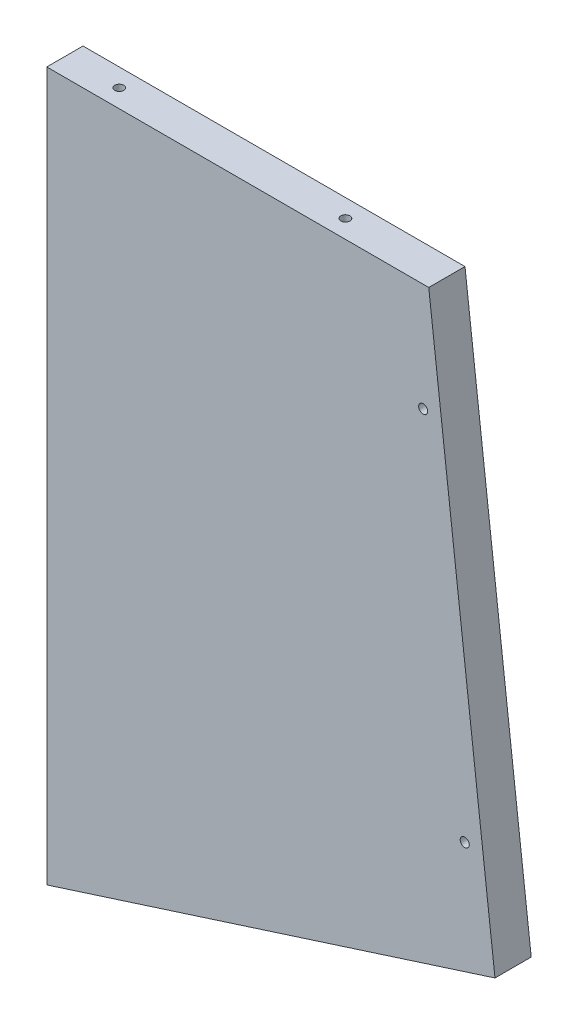
ISO-10303-21;
HEADER;
FILE_DESCRIPTION(('STEP AP214'),'2;1');
FILE_NAME('part.step','',(''),(''),'','','');
FILE_SCHEMA(('AUTOMOTIVE_DESIGN { 1 0 10303 214 1 1 1 1 }'));
ENDSEC;
DATA;
#1=APPLICATION_CONTEXT('core data for automotive mechanical design processes');
#2=APPLICATION_PROTOCOL_DEFINITION('international standard','automotive_design',2000,#1);
#3=PRODUCT_CONTEXT('',#1,'mechanical');
#4=PRODUCT('Part','Part','',(#3));
#5=PRODUCT_RELATED_PRODUCT_CATEGORY('part','',(#4));
#6=PRODUCT_DEFINITION_FORMATION('','',#4);
#7=PRODUCT_DEFINITION_CONTEXT('part definition',#1,'design');
#8=PRODUCT_DEFINITION('design','',#6,#7);
#9=PRODUCT_DEFINITION_SHAPE('','',#8);
#10=(LENGTH_UNIT() NAMED_UNIT(*) SI_UNIT(.MILLI.,.METRE.));
#11=(NAMED_UNIT(*) PLANE_ANGLE_UNIT() SI_UNIT($,.RADIAN.));
#12=(NAMED_UNIT(*) SI_UNIT($,.STERADIAN.) SOLID_ANGLE_UNIT());
#13=UNCERTAINTY_MEASURE_WITH_UNIT(LENGTH_MEASURE(1.E-05),#10,'distance_accuracy_value','');
#14=(GEOMETRIC_REPRESENTATION_CONTEXT(3) GLOBAL_UNCERTAINTY_ASSIGNED_CONTEXT((#13)) GLOBAL_UNIT_ASSIGNED_CONTEXT((#10,
#11,#12)) REPRESENTATION_CONTEXT('',''));
#15=CARTESIAN_POINT('',(0.,0.,0.));
#16=DIRECTION('',(0.,0.,1.));
#17=DIRECTION('',(1.,0.,0.));
#18=AXIS2_PLACEMENT_3D('',#15,#16,#17);
#19=CARTESIAN_POINT('',(-64.9774169834746,-197.96604829264,12.6999999999997));
#20=DIRECTION('',(0.993195579602869,0.11645832154604,0.));
#21=DIRECTION('',(-0.11645832154604,0.993195579602869,0.));
#22=AXIS2_PLACEMENT_3D('',#19,#20,#21);
#23=PLANE('',#22);
#24=DIRECTION('',(-0.11645832154604,0.993195579602869,0.));
#25=VECTOR('',#24,1.);
#26=CARTESIAN_POINT('',(-64.9774169834746,-197.96604829264,0.));
#27=LINE('',#26,#25);
#28=CARTESIAN_POINT('',(-64.9774169834746,-197.96604829264,0.));
#29=VERTEX_POINT('',#28);
#30=CARTESIAN_POINT('',(-88.1901599524695,0.,5.82867087928207E-13));
#31=VERTEX_POINT('',#30);
#32=EDGE_CURVE('E155',#29,#31,#27,.T.);
#33=ORIENTED_EDGE('',*,*,#32,.T.);
#34=DIRECTION('',(0.,0.,-1.));
#35=VECTOR('',#34,1.);
#36=CARTESIAN_POINT('',(-88.1901599524693,0.,12.7));
#37=LINE('',#36,#35);
#38=CARTESIAN_POINT('',(-88.1901599524693,0.,12.7));
#39=VERTEX_POINT('',#38);
#40=EDGE_CURVE('E158',#39,#31,#37,.T.);
#41=ORIENTED_EDGE('',*,*,#40,.F.);
#42=DIRECTION('',(-0.11645832154604,0.993195579602869,0.));
#43=VECTOR('',#42,1.);
#44=CARTESIAN_POINT('',(-64.9774169834746,-197.96604829264,12.6999999999997));
#45=LINE('',#44,#43);
#46=CARTESIAN_POINT('',(-64.9774169834746,-197.96604829264,12.6999999999997));
#47=VERTEX_POINT('',#46);
#48=EDGE_CURVE('E178',#47,#39,#45,.T.);
#49=ORIENTED_EDGE('',*,*,#48,.F.);
#50=DIRECTION('',(0.,0.,-1.));
#51=VECTOR('',#50,1.);
#52=CARTESIAN_POINT('',(-64.9774169834746,-197.96604829264,12.6999999999997));
#53=LINE('',#52,#51);
#54=EDGE_CURVE('E160',#47,#29,#53,.T.);
#55=ORIENTED_EDGE('',*,*,#54,.T.);
#56=EDGE_LOOP('',(#33,#41,#49,#55));
#57=FACE_BOUND('',#56,.T.);
#58=ADVANCED_FACE('F34',(#57),#23,.T.);
#59=CARTESIAN_POINT('',(-64.9774169834746,-197.96604829264,12.6999999999997));
#60=DIRECTION('',(0.304884492171613,-0.952389335531041,0.));
#61=DIRECTION('',(0.952389335531041,0.304884492171613,0.));
#62=AXIS2_PLACEMENT_3D('',#59,#60,#61);
#63=PLANE('',#62);
#64=CARTESIAN_POINT('',(-104.312526919559,-210.558235720579,6.40852136660416));
#65=DIRECTION('',(0.304884492171613,-0.952389335531041,0.));
#66=DIRECTION('',(0.952389335531041,0.304884492171613,0.));
#67=AXIS2_PLACEMENT_3D('',#64,#65,#66);
#68=CIRCLE('',#67,1.5875);
#69=CARTESIAN_POINT('',(-103.792995600886,-210.391920290165,7.89935423333476));
#70=VERTEX_POINT('',#69);
#71=CARTESIAN_POINT('',(-104.641973395736,-210.663700069916,4.85916713326899));
#72=VERTEX_POINT('',#71);
#73=EDGE_CURVE('E358',#70,#72,#68,.T.);
#74=ORIENTED_EDGE('',*,*,#73,.F.);
#75=CARTESIAN_POINT('',(-104.122442077063,-210.497384639502,6.34999999999961));
#76=DIRECTION('',(-0.304884492171613,0.952389335531041,0.));
#77=DIRECTION('',(0.952389335531041,0.304884492171613,0.));
#78=AXIS2_PLACEMENT_3D('',#75,#76,#77);
#79=CIRCLE('',#78,1.5875);
#80=EDGE_CURVE('E214',#70,#72,#79,.T.);
#81=ORIENTED_EDGE('',*,*,#80,.T.);
#82=EDGE_LOOP('',(#74,#81));
#83=FACE_BOUND('',#82,.T.);
#84=CARTESIAN_POINT('',(-197.476384754103,-240.382399457981,6.55935774992167));
#85=DIRECTION('',(0.304884492171613,-0.952389335531041,0.));
#86=DIRECTION('',(0.952389335531041,0.304884492171613,0.));
#87=AXIS2_PLACEMENT_3D('',#84,#85,#86);
#88=CIRCLE('',#87,1.5875);
#89=CARTESIAN_POINT('',(-196.291325885167,-240.003031422273,7.5451932436221));
#90=VERTEX_POINT('',#89);
#91=CARTESIAN_POINT('',(-198.471469535596,-240.700951868171,5.36416450629809));
#92=VERTEX_POINT('',#91);
#93=EDGE_CURVE('E230',#90,#92,#88,.T.);
#94=ORIENTED_EDGE('',*,*,#93,.F.);
#95=CARTESIAN_POINT('',(-197.286410666661,-240.321583832464,6.34999999999961));
#96=DIRECTION('',(-0.304884492171613,0.952389335531041,0.));
#97=DIRECTION('',(0.952389335531041,0.304884492171613,0.));
#98=AXIS2_PLACEMENT_3D('',#95,#96,#97);
#99=CIRCLE('',#98,1.5875);
#100=EDGE_CURVE('E210',#90,#92,#99,.T.);
#101=ORIENTED_EDGE('',*,*,#100,.T.);
#102=EDGE_LOOP('',(#94,#101));
#103=FACE_BOUND('',#102,.T.);
#104=DIRECTION('',(0.952389335531041,0.304884492171613,0.));
#105=VECTOR('',#104,1.);
#106=CARTESIAN_POINT('',(-64.9774169834746,-197.96604829264,0.));
#107=LINE('',#106,#105);
#108=CARTESIAN_POINT('',(-222.05296718065,-248.249999999995,0.));
#109=VERTEX_POINT('',#108);
#110=EDGE_CURVE('E176',#109,#29,#107,.T.);
#111=ORIENTED_EDGE('',*,*,#110,.T.);
#112=ORIENTED_EDGE('',*,*,#54,.F.);
#113=DIRECTION('',(0.952389335531041,0.304884492171613,0.));
#114=VECTOR('',#113,1.);
#115=CARTESIAN_POINT('',(-64.9774169834746,-197.96604829264,12.6999999999997));
#116=LINE('',#115,#114);
#117=CARTESIAN_POINT('',(-222.05296718065,-248.249999999995,12.7));
#118=VERTEX_POINT('',#117);
#119=EDGE_CURVE('E172',#118,#47,#116,.T.);
#120=ORIENTED_EDGE('',*,*,#119,.F.);
#121=DIRECTION('',(0.,0.,-1.));
#122=VECTOR('',#121,1.);
#123=CARTESIAN_POINT('',(-222.05296718065,-248.249999999995,12.7));
#124=LINE('',#123,#122);
#125=EDGE_CURVE('E181',#118,#109,#124,.T.);
#126=ORIENTED_EDGE('',*,*,#125,.T.);
#127=EDGE_LOOP('',(#111,#112,#120,#126));
#128=FACE_BOUND('',#127,.T.);
#129=ADVANCED_FACE('F142',(#83,#103,#128),#63,.T.);
#130=CARTESIAN_POINT('',(-222.05296718065,-248.249999999995,12.7));
#131=DIRECTION('',(-1.,0.,0.));
#132=DIRECTION('',(0.,-1.,0.));
#133=AXIS2_PLACEMENT_3D('',#130,#131,#132);
#134=PLANE('',#133);
#135=CARTESIAN_POINT('',(-222.05296718065,-210.149999999995,6.35000000000113));
#136=DIRECTION('',(1.,0.,0.));
#137=DIRECTION('',(0.,-1.,0.));
#138=AXIS2_PLACEMENT_3D('',#135,#136,#137);
#139=CIRCLE('',#138,1.58749999999999);
#140=CARTESIAN_POINT('',(-222.05296718065,-211.737499999995,6.35000000000113));
#141=VERTEX_POINT('',#140);
#142=EDGE_CURVE('E188',#141,#141,#139,.T.);
#143=ORIENTED_EDGE('',*,*,#142,.T.);
#144=EDGE_LOOP('',(#143));
#145=FACE_BOUND('',#144,.T.);
#146=CARTESIAN_POINT('',(-222.05296718065,-38.1000000000009,6.35000000000113));
#147=DIRECTION('',(1.,0.,0.));
#148=DIRECTION('',(0.,-1.,0.));
#149=AXIS2_PLACEMENT_3D('',#146,#147,#148);
#150=CIRCLE('',#149,1.5875);
#151=CARTESIAN_POINT('',(-222.05296718065,-39.6875000000009,6.35000000000113));
#152=VERTEX_POINT('',#151);
#153=EDGE_CURVE('E164',#152,#152,#150,.T.);
#154=ORIENTED_EDGE('',*,*,#153,.T.);
#155=EDGE_LOOP('',(#154));
#156=FACE_BOUND('',#155,.T.);
#157=DIRECTION('',(0.,-1.,0.));
#158=VECTOR('',#157,1.);
#159=CARTESIAN_POINT('',(-222.05296718065,-248.249999999995,0.));
#160=LINE('',#159,#158);
#161=CARTESIAN_POINT('',(-222.05296718065,0.,0.));
#162=VERTEX_POINT('',#161);
#163=EDGE_CURVE('E166',#162,#109,#160,.T.);
#164=ORIENTED_EDGE('',*,*,#163,.T.);
#165=ORIENTED_EDGE('',*,*,#125,.F.);
#166=DIRECTION('',(0.,-1.,0.));
#167=VECTOR('',#166,1.);
#168=CARTESIAN_POINT('',(-222.05296718065,-248.249999999995,12.7));
#169=LINE('',#168,#167);
#170=CARTESIAN_POINT('',(-222.05296718065,-2.22044604925031E-13,12.7));
#171=VERTEX_POINT('',#170);
#172=EDGE_CURVE('E263',#171,#118,#169,.T.);
#173=ORIENTED_EDGE('',*,*,#172,.F.);
#174=DIRECTION('',(0.,0.,-1.));
#175=VECTOR('',#174,1.);
#176=CARTESIAN_POINT('',(-222.05296718065,-2.22044604925031E-13,12.7));
#177=LINE('',#176,#175);
#178=EDGE_CURVE('E184',#171,#162,#177,.T.);
#179=ORIENTED_EDGE('',*,*,#178,.T.);
#180=EDGE_LOOP('',(#164,#165,#173,#179));
#181=FACE_BOUND('',#180,.T.);
#182=ADVANCED_FACE('F148',(#145,#156,#181),#134,.T.);
#183=CARTESIAN_POINT('',(-88.1901599524693,0.,12.7));
#184=DIRECTION('',(0.,1.,0.));
#185=DIRECTION('',(-1.,0.,0.));
#186=AXIS2_PLACEMENT_3D('',#183,#184,#185);
#187=PLANE('',#186);
#188=CARTESIAN_POINT('',(-203.00296718065,0.,6.35000000000011));
#189=DIRECTION('',(0.,-1.,0.));
#190=DIRECTION('',(-1.,0.,0.));
#191=AXIS2_PLACEMENT_3D('',#188,#189,#190);
#192=CIRCLE('',#191,1.58749999999999);
#193=CARTESIAN_POINT('',(-204.59046718065,0.,6.35000000000011));
#194=VERTEX_POINT('',#193);
#195=EDGE_CURVE('E206',#194,#194,#192,.T.);
#196=ORIENTED_EDGE('',*,*,#195,.T.);
#197=EDGE_LOOP('',(#196));
#198=FACE_BOUND('',#197,.T.);
#199=CARTESIAN_POINT('',(-123.747327392619,2.22044604925031E-13,6.35000000000069));
#200=DIRECTION('',(0.,-1.,0.));
#201=DIRECTION('',(-1.,0.,0.));
#202=AXIS2_PLACEMENT_3D('',#199,#200,#201);
#203=CIRCLE('',#202,1.5875);
#204=CARTESIAN_POINT('',(-125.334827392619,2.20458373778598E-13,6.35000000000069));
#205=VERTEX_POINT('',#204);
#206=EDGE_CURVE('E201',#205,#205,#203,.T.);
#207=ORIENTED_EDGE('',*,*,#206,.T.);
#208=EDGE_LOOP('',(#207));
#209=FACE_BOUND('',#208,.T.);
#210=DIRECTION('',(-1.,0.,0.));
#211=VECTOR('',#210,1.);
#212=CARTESIAN_POINT('',(-88.1901599524695,0.,5.82867087928207E-13));
#213=LINE('',#212,#211);
#214=EDGE_CURVE('E163',#31,#162,#213,.T.);
#215=ORIENTED_EDGE('',*,*,#214,.T.);
#216=ORIENTED_EDGE('',*,*,#178,.F.);
#217=DIRECTION('',(-1.,0.,0.));
#218=VECTOR('',#217,1.);
#219=CARTESIAN_POINT('',(-88.1901599524693,0.,12.7));
#220=LINE('',#219,#218);
#221=EDGE_CURVE('E262',#39,#171,#220,.T.);
#222=ORIENTED_EDGE('',*,*,#221,.F.);
#223=ORIENTED_EDGE('',*,*,#40,.T.);
#224=EDGE_LOOP('',(#215,#216,#222,#223));
#225=FACE_BOUND('',#224,.T.);
#226=ADVANCED_FACE('F274',(#198,#209,#225),#187,.T.);
#227=CARTESIAN_POINT('',(0.,0.,12.7));
#228=DIRECTION('',(0.,0.,-1.));
#229=DIRECTION('',(1.,0.,0.));
#230=AXIS2_PLACEMENT_3D('',#227,#228,#229);
#231=PLANE('',#230);
#232=CARTESIAN_POINT('',(-75.5766743950045,-162.097975038985,12.7));
#233=DIRECTION('',(0.,0.,1.));
#234=DIRECTION('',(1.,0.,0.));
#235=AXIS2_PLACEMENT_3D('',#232,#233,#234);
#236=CIRCLE('',#235,1.5875);
#237=CARTESIAN_POINT('',(-73.9891743950046,-162.097975038985,12.7));
#238=VERTEX_POINT('',#237);
#239=EDGE_CURVE('E196',#238,#238,#236,.T.);
#240=ORIENTED_EDGE('',*,*,#239,.F.);
#241=EDGE_LOOP('',(#240));
#242=FACE_BOUND('',#241,.T.);
#243=CARTESIAN_POINT('',(-90.1466019911969,-37.8407515828578,12.7));
#244=DIRECTION('',(0.,0.,1.));
#245=DIRECTION('',(1.,0.,0.));
#246=AXIS2_PLACEMENT_3D('',#243,#244,#245);
#247=CIRCLE('',#246,1.5875);
#248=CARTESIAN_POINT('',(-88.5591019911969,-37.8407515828578,12.7));
#249=VERTEX_POINT('',#248);
#250=EDGE_CURVE('E192',#249,#249,#247,.T.);
#251=ORIENTED_EDGE('',*,*,#250,.F.);
#252=EDGE_LOOP('',(#251));
#253=FACE_BOUND('',#252,.T.);
#254=ORIENTED_EDGE('',*,*,#48,.T.);
#255=ORIENTED_EDGE('',*,*,#221,.T.);
#256=ORIENTED_EDGE('',*,*,#172,.T.);
#257=ORIENTED_EDGE('',*,*,#119,.T.);
#258=EDGE_LOOP('',(#254,#255,#256,#257));
#259=FACE_BOUND('',#258,.T.);
#260=ADVANCED_FACE('F268',(#242,#253,#259),#231,.F.);
#261=CARTESIAN_POINT('',(0.,0.,0.));
#262=DIRECTION('',(0.,0.,-1.));
#263=DIRECTION('',(1.,0.,0.));
#264=AXIS2_PLACEMENT_3D('',#261,#262,#263);
#265=PLANE('',#264);
#266=CARTESIAN_POINT('',(-75.5766743950048,-162.097975038985,-4.32986979603811E-12));
#267=DIRECTION('',(0.,0.,1.));
#268=DIRECTION('',(1.,0.,0.));
#269=AXIS2_PLACEMENT_3D('',#266,#267,#268);
#270=CIRCLE('',#269,5.08);
#271=CARTESIAN_POINT('',(-70.4966743950048,-162.097975038985,-4.32986979603895E-12));
#272=VERTEX_POINT('',#271);
#273=EDGE_CURVE('E204',#272,#272,#270,.T.);
#274=ORIENTED_EDGE('',*,*,#273,.T.);
#275=EDGE_LOOP('',(#274));
#276=FACE_BOUND('',#275,.T.);
#277=CARTESIAN_POINT('',(-90.1466019911969,-37.8407515828578,-4.32986979603811E-12));
#278=DIRECTION('',(0.,0.,1.));
#279=DIRECTION('',(1.,0.,0.));
#280=AXIS2_PLACEMENT_3D('',#277,#278,#279);
#281=CIRCLE('',#280,5.08);
#282=CARTESIAN_POINT('',(-85.0666019911969,-37.8407515828578,-4.32986979603895E-12));
#283=VERTEX_POINT('',#282);
#284=EDGE_CURVE('E199',#283,#283,#281,.T.);
#285=ORIENTED_EDGE('',*,*,#284,.T.);
#286=EDGE_LOOP('',(#285));
#287=FACE_BOUND('',#286,.T.);
#288=ORIENTED_EDGE('',*,*,#32,.F.);
#289=ORIENTED_EDGE('',*,*,#110,.F.);
#290=ORIENTED_EDGE('',*,*,#163,.F.);
#291=ORIENTED_EDGE('',*,*,#214,.F.);
#292=EDGE_LOOP('',(#288,#289,#290,#291));
#293=FACE_BOUND('',#292,.T.);
#294=ADVANCED_FACE('F270',(#276,#287,#293),#265,.T.);
#295=CARTESIAN_POINT('',(-203.002967180653,-38.1000000000007,6.35000000000113));
#296=DIRECTION('',(-1.,0.,0.));
#297=DIRECTION('',(0.,0.,-1.));
#298=AXIS2_PLACEMENT_3D('',#295,#296,#297);
#299=CONICAL_SURFACE('',#298,1.5875,1.02974425867666);
#300=CARTESIAN_POINT('',(-202.049100947947,-38.1000000000007,6.35000000000113));
#301=VERTEX_POINT('',#300);
#302=VERTEX_LOOP('',#301);
#303=FACE_BOUND('',#302,.T.);
#304=CARTESIAN_POINT('',(-203.002967180653,-38.1000000000007,6.35000000000113));
#305=DIRECTION('',(1.,0.,0.));
#306=DIRECTION('',(0.,0.,-1.));
#307=AXIS2_PLACEMENT_3D('',#304,#305,#306);
#308=CIRCLE('',#307,1.5875);
#309=CARTESIAN_POINT('',(-203.002967180653,-38.1000000000007,4.76250000000113));
#310=VERTEX_POINT('',#309);
#311=EDGE_CURVE('E169',#310,#310,#308,.T.);
#312=ORIENTED_EDGE('',*,*,#311,.F.);
#313=EDGE_LOOP('',(#312));
#314=FACE_BOUND('',#313,.T.);
#315=ADVANCED_FACE('F287',(#303,#314),#299,.F.);
#316=CARTESIAN_POINT('',(-234.752967180653,-38.1000000000009,6.35000000000055));
#317=DIRECTION('',(-1.,0.,0.));
#318=DIRECTION('',(0.,0.,-1.));
#319=AXIS2_PLACEMENT_3D('',#316,#317,#318);
#320=CYLINDRICAL_SURFACE('',#319,1.5875);
#321=ORIENTED_EDGE('',*,*,#153,.F.);
#322=EDGE_LOOP('',(#321));
#323=FACE_BOUND('',#322,.T.);
#324=ORIENTED_EDGE('',*,*,#311,.T.);
#325=EDGE_LOOP('',(#324));
#326=FACE_BOUND('',#325,.T.);
#327=ADVANCED_FACE('F292',(#323,#326),#320,.F.);
#328=CARTESIAN_POINT('',(-203.002967180653,-210.149999999995,6.35000000000113));
#329=DIRECTION('',(-1.,0.,0.));
#330=DIRECTION('',(0.,0.,-1.));
#331=AXIS2_PLACEMENT_3D('',#328,#329,#330);
#332=CONICAL_SURFACE('',#331,1.58749999999999,1.02974425867666);
#333=CARTESIAN_POINT('',(-202.049100947947,-210.149999999995,6.35000000000113));
#334=VERTEX_POINT('',#333);
#335=VERTEX_LOOP('',#334);
#336=FACE_BOUND('',#335,.T.);
#337=CARTESIAN_POINT('',(-203.002967180653,-210.149999999995,6.35000000000113));
#338=DIRECTION('',(1.,0.,0.));
#339=DIRECTION('',(0.,0.,-1.));
#340=AXIS2_PLACEMENT_3D('',#337,#338,#339);
#341=CIRCLE('',#340,1.58749999999999);
#342=CARTESIAN_POINT('',(-203.002967180653,-210.149999999995,4.76250000000114));
#343=VERTEX_POINT('',#342);
#344=EDGE_CURVE('E191',#343,#343,#341,.T.);
#345=ORIENTED_EDGE('',*,*,#344,.F.);
#346=EDGE_LOOP('',(#345));
#347=FACE_BOUND('',#346,.T.);
#348=ADVANCED_FACE('F296',(#336,#347),#332,.F.);
#349=CARTESIAN_POINT('',(-234.752967180653,-210.149999999995,6.35000000000113));
#350=DIRECTION('',(-1.,0.,0.));
#351=DIRECTION('',(0.,0.,-1.));
#352=AXIS2_PLACEMENT_3D('',#349,#350,#351);
#353=CYLINDRICAL_SURFACE('',#352,1.58749999999999);
#354=ORIENTED_EDGE('',*,*,#142,.F.);
#355=EDGE_LOOP('',(#354));
#356=FACE_BOUND('',#355,.T.);
#357=ORIENTED_EDGE('',*,*,#344,.T.);
#358=EDGE_LOOP('',(#357));
#359=FACE_BOUND('',#358,.T.);
#360=ADVANCED_FACE('F300',(#356,#359),#353,.F.);
#361=CARTESIAN_POINT('',(-90.1466019911969,-37.8407515828578,-4.32986979603811E-12));
#362=DIRECTION('',(0.,0.,-1.));
#363=DIRECTION('',(1.,0.,0.));
#364=AXIS2_PLACEMENT_3D('',#361,#362,#363);
#365=CYLINDRICAL_SURFACE('',#364,1.5875);
#366=CARTESIAN_POINT('',(-90.1466019911969,-37.8407515828578,4.01766166221504));
#367=DIRECTION('',(0.,0.,1.));
#368=DIRECTION('',(1.,0.,0.));
#369=AXIS2_PLACEMENT_3D('',#366,#367,#368);
#370=CIRCLE('',#369,1.58749999999999);
#371=CARTESIAN_POINT('',(-88.5591019911969,-37.8407515828578,4.01766166221504));
#372=VERTEX_POINT('',#371);
#373=EDGE_CURVE('E195',#372,#372,#370,.T.);
#374=ORIENTED_EDGE('',*,*,#373,.F.);
#375=EDGE_LOOP('',(#374));
#376=FACE_BOUND('',#375,.T.);
#377=ORIENTED_EDGE('',*,*,#250,.T.);
#378=EDGE_LOOP('',(#377));
#379=FACE_BOUND('',#378,.T.);
#380=ADVANCED_FACE('F304',(#376,#379),#365,.F.);
#381=CARTESIAN_POINT('',(-90.1466019911969,-37.8407515828578,-4.32986979603811E-12));
#382=DIRECTION('',(0.,0.,-1.));
#383=DIRECTION('',(1.,0.,0.));
#384=AXIS2_PLACEMENT_3D('',#381,#382,#383);
#385=CONICAL_SURFACE('',#384,5.08,0.715584993317678);
#386=CARTESIAN_POINT('',(-88.5591019911969,-37.8407515828578,4.01766166221504));
#387=CARTESIAN_POINT('',(-88.5227217828636,-37.8407515828578,3.97581101990026));
#388=CARTESIAN_POINT('',(-88.4863415745302,-37.8407515828578,3.93396037758547));
#389=CARTESIAN_POINT('',(-88.4135811578636,-37.8407515828578,3.8502590929559));
#390=CARTESIAN_POINT('',(-88.3772009495302,-37.8407515828578,3.80840845064111));
#391=CARTESIAN_POINT('',(-88.3044405328636,-37.8407515828578,3.72470716601154));
#392=CARTESIAN_POINT('',(-88.2680603245302,-37.8407515828578,3.68285652369676));
#393=CARTESIAN_POINT('',(-88.1952999078636,-37.8407515828578,3.59915523906719));
#394=CARTESIAN_POINT('',(-88.1589196995302,-37.8407515828578,3.5573045967524));
#395=CARTESIAN_POINT('',(-88.0861592828636,-37.8407515828578,3.47360331212283));
#396=CARTESIAN_POINT('',(-88.0497790745302,-37.8407515828578,3.43175266980805));
#397=CARTESIAN_POINT('',(-87.9770186578636,-37.8407515828578,3.34805138517848));
#398=CARTESIAN_POINT('',(-87.9406384495302,-37.8407515828578,3.30620074286369));
#399=CARTESIAN_POINT('',(-87.8678780328636,-37.8407515828578,3.22249945823412));
#400=CARTESIAN_POINT('',(-87.8314978245302,-37.8407515828578,3.18064881591934));
#401=CARTESIAN_POINT('',(-87.7587374078636,-37.8407515828578,3.09694753128977));
#402=CARTESIAN_POINT('',(-87.7223571995302,-37.8407515828578,3.05509688897498));
#403=CARTESIAN_POINT('',(-87.6495967828636,-37.8407515828578,2.97139560434541));
#404=CARTESIAN_POINT('',(-87.6132165745302,-37.8407515828578,2.92954496203063));
#405=CARTESIAN_POINT('',(-87.5404561578636,-37.8407515828578,2.84584367740106));
#406=CARTESIAN_POINT('',(-87.5040759495302,-37.8407515828578,2.80399303508627));
#407=CARTESIAN_POINT('',(-87.4313155328636,-37.8407515828578,2.7202917504567));
#408=CARTESIAN_POINT('',(-87.3949353245302,-37.8407515828578,2.67844110814192));
#409=CARTESIAN_POINT('',(-87.3221749078636,-37.8407515828578,2.59473982351235));
#410=CARTESIAN_POINT('',(-87.2857946995302,-37.8407515828578,2.55288918119756));
#411=CARTESIAN_POINT('',(-87.2130342828636,-37.8407515828578,2.46918789656799));
#412=CARTESIAN_POINT('',(-87.1766540745302,-37.8407515828578,2.42733725425321));
#413=CARTESIAN_POINT('',(-87.1038936578636,-37.8407515828578,2.34363596962364));
#414=CARTESIAN_POINT('',(-87.0675134495302,-37.8407515828578,2.30178532730885));
#415=CARTESIAN_POINT('',(-86.9947530328636,-37.8407515828578,2.21808404267928));
#416=CARTESIAN_POINT('',(-86.9583728245302,-37.8407515828578,2.17623340036449));
#417=CARTESIAN_POINT('',(-86.8856124078636,-37.8407515828578,2.09253211573493));
#418=CARTESIAN_POINT('',(-86.8492321995302,-37.8407515828578,2.05068147342014));
#419=CARTESIAN_POINT('',(-86.7764717828636,-37.8407515828578,1.96698018879057));
#420=CARTESIAN_POINT('',(-86.7400915745302,-37.8407515828578,1.92512954647579));
#421=CARTESIAN_POINT('',(-86.6673311578636,-37.8407515828578,1.84142826184621));
#422=CARTESIAN_POINT('',(-86.6309509495302,-37.8407515828578,1.79957761953143));
#423=CARTESIAN_POINT('',(-86.5581905328636,-37.8407515828578,1.71587633490186));
#424=CARTESIAN_POINT('',(-86.5218103245302,-37.8407515828578,1.67402569258707));
#425=CARTESIAN_POINT('',(-86.4490499078636,-37.8407515828578,1.5903244079575));
#426=CARTESIAN_POINT('',(-86.4126696995302,-37.8407515828578,1.54847376564272));
#427=CARTESIAN_POINT('',(-86.3399092828636,-37.8407515828578,1.46477248101315));
#428=CARTESIAN_POINT('',(-86.3035290745302,-37.8407515828578,1.42292183869836));
#429=CARTESIAN_POINT('',(-86.2307686578636,-37.8407515828578,1.33922055406879));
#430=CARTESIAN_POINT('',(-86.1943884495302,-37.8407515828578,1.29736991175401));
#431=CARTESIAN_POINT('',(-86.1216280328636,-37.8407515828578,1.21366862712444));
#432=CARTESIAN_POINT('',(-86.0852478245302,-37.8407515828578,1.17181798480965));
#433=CARTESIAN_POINT('',(-86.0124874078636,-37.8407515828578,1.08811670018008));
#434=CARTESIAN_POINT('',(-85.9761071995302,-37.8407515828578,1.0462660578653));
#435=CARTESIAN_POINT('',(-85.9033467828636,-37.8407515828578,0.962564773235727));
#436=CARTESIAN_POINT('',(-85.8669665745302,-37.8407515828578,0.920714130920943));
#437=CARTESIAN_POINT('',(-85.7942061578636,-37.8407515828578,0.837012846291373));
#438=CARTESIAN_POINT('',(-85.7578259495302,-37.8407515828578,0.795162203976586));
#439=CARTESIAN_POINT('',(-85.6850655328636,-37.8407515828578,0.711460919347015));
#440=CARTESIAN_POINT('',(-85.6486853245302,-37.8407515828578,0.669610277032231));
#441=CARTESIAN_POINT('',(-85.5759249078636,-37.8407515828578,0.585908992402662));
#442=CARTESIAN_POINT('',(-85.5395446995302,-37.8407515828578,0.544058350087876));
#443=CARTESIAN_POINT('',(-85.4667842828636,-37.8407515828578,0.460357065458306));
#444=CARTESIAN_POINT('',(-85.4304040745302,-37.8407515828578,0.418506423143522));
#445=CARTESIAN_POINT('',(-85.3576436578636,-37.8407515828578,0.334805138513952));
#446=CARTESIAN_POINT('',(-85.3212634495302,-37.8407515828578,0.292954496199165));
#447=CARTESIAN_POINT('',(-85.2485030328636,-37.8407515828578,0.209253211569594));
#448=CARTESIAN_POINT('',(-85.2121228245302,-37.8407515828578,0.16740256925481));
#449=CARTESIAN_POINT('',(-85.1393624078636,-37.8407515828578,0.0837012846252411));
#450=CARTESIAN_POINT('',(-85.1029821995302,-37.8407515828578,0.0418506423104568));
#451=CARTESIAN_POINT('',(-85.0666019911969,-37.8407515828578,-4.32986979603811E-12));
#452=B_SPLINE_CURVE_WITH_KNOTS('',3,(#386,#387,#388,#389,#390,#391,#392,#393,#394,#395,#396,
#397,#398,#399,#400,#401,#402,#403,#404,#405,#406,#407,#408,#409,#410,#411,#412,#413,#414,#415,
#416,#417,#418,#419,#420,#421,#422,#423,#424,#425,#426,#427,#428,#429,#430,#431,#432,#433,#434,
#435,#436,#437,#438,#439,#440,#441,#442,#443,#444,#445,#446,#447,#448,#449,#450,#451),
.UNSPECIFIED.,.F.,.F.,(4,2,2,2,2,2,2,2,2,2,2,2,2,2,2,2,2,2,2,2,2,2,2,2,2,2,2,2,2,2,2,2,4),(0.,
0.166357934541254,0.332715869082499,0.499073803623753,0.665431738165007,0.831789672706261,
0.998147607247506,1.16450554178876,1.33086347633001,1.49722141087127,1.66357934541251,
1.82993727995377,1.99629521449502,2.16265314903628,2.32901108357752,2.49536901811877,
2.66172695266003,2.82808488720128,2.99444282174253,3.16080075628378,3.32715869082504,
3.49351662536629,3.65987455990753,3.82623249444879,3.99259042899004,4.1589483635313,
4.32530629807254,4.4916642326138,4.65802216715505,4.8243801016963,4.99073803623755,
5.1570959707788,5.32345390532006),.UNSPECIFIED.);
#453=EDGE_CURVE('BSEAM308',#372,#283,#452,.T.);
#454=ORIENTED_EDGE('',*,*,#373,.T.);
#455=ORIENTED_EDGE('',*,*,#284,.F.);
#456=ORIENTED_EDGE('',*,*,#453,.T.);
#457=ORIENTED_EDGE('',*,*,#453,.F.);
#458=EDGE_LOOP('',(#454,#456,#455,#457));
#459=FACE_BOUND('',#458,.T.);
#460=ADVANCED_FACE('F308',(#459),#385,.F.);
#461=CARTESIAN_POINT('',(-75.5766743950048,-162.097975038985,-4.32986979603811E-12));
#462=DIRECTION('',(0.,0.,-1.));
#463=DIRECTION('',(1.,0.,0.));
#464=AXIS2_PLACEMENT_3D('',#461,#462,#463);
#465=CYLINDRICAL_SURFACE('',#464,1.5875);
#466=CARTESIAN_POINT('',(-75.5766743950048,-162.097975038985,4.01766166221504));
#467=DIRECTION('',(0.,0.,1.));
#468=DIRECTION('',(1.,0.,0.));
#469=AXIS2_PLACEMENT_3D('',#466,#467,#468);
#470=CIRCLE('',#469,1.58749999999999);
#471=CARTESIAN_POINT('',(-73.9891743950048,-162.097975038985,4.01766166221504));
#472=VERTEX_POINT('',#471);
#473=EDGE_CURVE('E200',#472,#472,#470,.T.);
#474=ORIENTED_EDGE('',*,*,#473,.F.);
#475=EDGE_LOOP('',(#474));
#476=FACE_BOUND('',#475,.T.);
#477=ORIENTED_EDGE('',*,*,#239,.T.);
#478=EDGE_LOOP('',(#477));
#479=FACE_BOUND('',#478,.T.);
#480=ADVANCED_FACE('F312',(#476,#479),#465,.F.);
#481=CARTESIAN_POINT('',(-75.5766743950048,-162.097975038985,-4.32986979603811E-12));
#482=DIRECTION('',(0.,0.,-1.));
#483=DIRECTION('',(1.,0.,0.));
#484=AXIS2_PLACEMENT_3D('',#481,#482,#483);
#485=CONICAL_SURFACE('',#484,5.08,0.715584993317678);
#486=CARTESIAN_POINT('',(-73.9891743950048,-162.097975038985,4.01766166221504));
#487=CARTESIAN_POINT('',(-73.9527941866714,-162.097975038985,3.97581101990026));
#488=CARTESIAN_POINT('',(-73.9164139783381,-162.097975038985,3.93396037758547));
#489=CARTESIAN_POINT('',(-73.8436535616714,-162.097975038985,3.8502590929559));
#490=CARTESIAN_POINT('',(-73.8072733533381,-162.097975038985,3.80840845064111));
#491=CARTESIAN_POINT('',(-73.7345129366714,-162.097975038985,3.72470716601154));
#492=CARTESIAN_POINT('',(-73.6981327283381,-162.097975038985,3.68285652369676));
#493=CARTESIAN_POINT('',(-73.6253723116714,-162.097975038985,3.59915523906719));
#494=CARTESIAN_POINT('',(-73.5889921033381,-162.097975038985,3.5573045967524));
#495=CARTESIAN_POINT('',(-73.5162316866714,-162.097975038985,3.47360331212283));
#496=CARTESIAN_POINT('',(-73.4798514783381,-162.097975038985,3.43175266980805));
#497=CARTESIAN_POINT('',(-73.4070910616714,-162.097975038985,3.34805138517848));
#498=CARTESIAN_POINT('',(-73.3707108533381,-162.097975038985,3.30620074286369));
#499=CARTESIAN_POINT('',(-73.2979504366714,-162.097975038985,3.22249945823412));
#500=CARTESIAN_POINT('',(-73.2615702283381,-162.097975038985,3.18064881591934));
#501=CARTESIAN_POINT('',(-73.1888098116714,-162.097975038985,3.09694753128977));
#502=CARTESIAN_POINT('',(-73.1524296033381,-162.097975038985,3.05509688897498));
#503=CARTESIAN_POINT('',(-73.0796691866714,-162.097975038985,2.97139560434541));
#504=CARTESIAN_POINT('',(-73.0432889783381,-162.097975038985,2.92954496203063));
#505=CARTESIAN_POINT('',(-72.9705285616714,-162.097975038985,2.84584367740106));
#506=CARTESIAN_POINT('',(-72.9341483533381,-162.097975038985,2.80399303508627));
#507=CARTESIAN_POINT('',(-72.8613879366714,-162.097975038985,2.7202917504567));
#508=CARTESIAN_POINT('',(-72.8250077283381,-162.097975038985,2.67844110814192));
#509=CARTESIAN_POINT('',(-72.7522473116714,-162.097975038985,2.59473982351235));
#510=CARTESIAN_POINT('',(-72.7158671033381,-162.097975038985,2.55288918119756));
#511=CARTESIAN_POINT('',(-72.6431066866714,-162.097975038985,2.46918789656799));
#512=CARTESIAN_POINT('',(-72.6067264783381,-162.097975038985,2.42733725425321));
#513=CARTESIAN_POINT('',(-72.5339660616714,-162.097975038985,2.34363596962364));
#514=CARTESIAN_POINT('',(-72.4975858533381,-162.097975038985,2.30178532730885));
#515=CARTESIAN_POINT('',(-72.4248254366714,-162.097975038985,2.21808404267928));
#516=CARTESIAN_POINT('',(-72.3884452283381,-162.097975038985,2.17623340036449));
#517=CARTESIAN_POINT('',(-72.3156848116714,-162.097975038985,2.09253211573493));
#518=CARTESIAN_POINT('',(-72.2793046033381,-162.097975038985,2.05068147342014));
#519=CARTESIAN_POINT('',(-72.2065441866714,-162.097975038985,1.96698018879057));
#520=CARTESIAN_POINT('',(-72.1701639783381,-162.097975038985,1.92512954647579));
#521=CARTESIAN_POINT('',(-72.0974035616714,-162.097975038985,1.84142826184621));
#522=CARTESIAN_POINT('',(-72.0610233533381,-162.097975038985,1.79957761953143));
#523=CARTESIAN_POINT('',(-71.9882629366714,-162.097975038985,1.71587633490186));
#524=CARTESIAN_POINT('',(-71.9518827283381,-162.097975038985,1.67402569258707));
#525=CARTESIAN_POINT('',(-71.8791223116714,-162.097975038985,1.5903244079575));
#526=CARTESIAN_POINT('',(-71.8427421033381,-162.097975038985,1.54847376564272));
#527=CARTESIAN_POINT('',(-71.7699816866714,-162.097975038985,1.46477248101315));
#528=CARTESIAN_POINT('',(-71.7336014783381,-162.097975038985,1.42292183869836));
#529=CARTESIAN_POINT('',(-71.6608410616714,-162.097975038985,1.33922055406879));
#530=CARTESIAN_POINT('',(-71.6244608533381,-162.097975038985,1.29736991175401));
#531=CARTESIAN_POINT('',(-71.5517004366714,-162.097975038985,1.21366862712444));
#532=CARTESIAN_POINT('',(-71.5153202283381,-162.097975038985,1.17181798480965));
#533=CARTESIAN_POINT('',(-71.4425598116714,-162.097975038985,1.08811670018008));
#534=CARTESIAN_POINT('',(-71.4061796033381,-162.097975038985,1.0462660578653));
#535=CARTESIAN_POINT('',(-71.3334191866714,-162.097975038985,0.962564773235727));
#536=CARTESIAN_POINT('',(-71.2970389783381,-162.097975038985,0.920714130920943));
#537=CARTESIAN_POINT('',(-71.2242785616714,-162.097975038985,0.837012846291373));
#538=CARTESIAN_POINT('',(-71.1878983533381,-162.097975038985,0.795162203976586));
#539=CARTESIAN_POINT('',(-71.1151379366714,-162.097975038985,0.711460919347015));
#540=CARTESIAN_POINT('',(-71.0787577283381,-162.097975038985,0.669610277032231));
#541=CARTESIAN_POINT('',(-71.0059973116714,-162.097975038985,0.585908992402662));
#542=CARTESIAN_POINT('',(-70.9696171033381,-162.097975038985,0.544058350087876));
#543=CARTESIAN_POINT('',(-70.8968566866714,-162.097975038985,0.460357065458306));
#544=CARTESIAN_POINT('',(-70.8604764783381,-162.097975038985,0.418506423143522));
#545=CARTESIAN_POINT('',(-70.7877160616714,-162.097975038985,0.334805138513952));
#546=CARTESIAN_POINT('',(-70.7513358533381,-162.097975038985,0.292954496199165));
#547=CARTESIAN_POINT('',(-70.6785754366714,-162.097975038985,0.209253211569594));
#548=CARTESIAN_POINT('',(-70.6421952283381,-162.097975038985,0.16740256925481));
#549=CARTESIAN_POINT('',(-70.5694348116714,-162.097975038985,0.0837012846252411));
#550=CARTESIAN_POINT('',(-70.5330546033381,-162.097975038985,0.0418506423104568));
#551=CARTESIAN_POINT('',(-70.4966743950048,-162.097975038985,-4.32986979603811E-12));
#552=B_SPLINE_CURVE_WITH_KNOTS('',3,(#486,#487,#488,#489,#490,#491,#492,#493,#494,#495,#496,
#497,#498,#499,#500,#501,#502,#503,#504,#505,#506,#507,#508,#509,#510,#511,#512,#513,#514,#515,
#516,#517,#518,#519,#520,#521,#522,#523,#524,#525,#526,#527,#528,#529,#530,#531,#532,#533,#534,
#535,#536,#537,#538,#539,#540,#541,#542,#543,#544,#545,#546,#547,#548,#549,#550,#551),
.UNSPECIFIED.,.F.,.F.,(4,2,2,2,2,2,2,2,2,2,2,2,2,2,2,2,2,2,2,2,2,2,2,2,2,2,2,2,2,2,2,2,4),(0.,
0.166357934541254,0.332715869082499,0.499073803623753,0.665431738165007,0.831789672706261,
0.998147607247506,1.16450554178876,1.33086347633001,1.49722141087127,1.66357934541251,
1.82993727995377,1.99629521449502,2.16265314903628,2.32901108357752,2.49536901811877,
2.66172695266003,2.82808488720128,2.99444282174253,3.16080075628378,3.32715869082504,
3.49351662536629,3.65987455990753,3.82623249444879,3.99259042899004,4.1589483635313,
4.32530629807254,4.4916642326138,4.65802216715505,4.8243801016963,4.99073803623755,
5.1570959707788,5.32345390532006),.UNSPECIFIED.);
#553=EDGE_CURVE('BSEAM316',#472,#272,#552,.T.);
#554=ORIENTED_EDGE('',*,*,#473,.T.);
#555=ORIENTED_EDGE('',*,*,#273,.F.);
#556=ORIENTED_EDGE('',*,*,#553,.T.);
#557=ORIENTED_EDGE('',*,*,#553,.F.);
#558=EDGE_LOOP('',(#554,#556,#555,#557));
#559=FACE_BOUND('',#558,.T.);
#560=ADVANCED_FACE('F316',(#559),#485,.F.);
#561=CARTESIAN_POINT('',(-123.747327392619,-19.0499999999989,6.35000000000011));
#562=DIRECTION('',(0.,1.,0.));
#563=DIRECTION('',(0.,0.,-1.));
#564=AXIS2_PLACEMENT_3D('',#561,#562,#563);
#565=CONICAL_SURFACE('',#564,1.58750000000001,1.02974425867666);
#566=CARTESIAN_POINT('',(-123.747327392619,-20.0038662327053,6.35000000000011));
#567=VERTEX_POINT('',#566);
#568=VERTEX_LOOP('',#567);
#569=FACE_BOUND('',#568,.T.);
#570=CARTESIAN_POINT('',(-123.747327392619,-19.0499999999989,6.35000000000011));
#571=DIRECTION('',(0.,-1.,0.));
#572=DIRECTION('',(0.,0.,-1.));
#573=AXIS2_PLACEMENT_3D('',#570,#571,#572);
#574=CIRCLE('',#573,1.58750000000001);
#575=CARTESIAN_POINT('',(-123.747327392619,-19.0499999999989,4.7625000000001));
#576=VERTEX_POINT('',#575);
#577=EDGE_CURVE('E205',#576,#576,#574,.T.);
#578=ORIENTED_EDGE('',*,*,#577,.F.);
#579=EDGE_LOOP('',(#578));
#580=FACE_BOUND('',#579,.T.);
#581=ADVANCED_FACE('F320',(#569,#580),#565,.F.);
#582=CARTESIAN_POINT('',(-123.747327392619,12.7000000000008,6.34999999999952));
#583=DIRECTION('',(0.,1.,0.));
#584=DIRECTION('',(0.,0.,-1.));
#585=AXIS2_PLACEMENT_3D('',#582,#583,#584);
#586=CYLINDRICAL_SURFACE('',#585,1.5875);
#587=ORIENTED_EDGE('',*,*,#206,.F.);
#588=EDGE_LOOP('',(#587));
#589=FACE_BOUND('',#588,.T.);
#590=ORIENTED_EDGE('',*,*,#577,.T.);
#591=EDGE_LOOP('',(#590));
#592=FACE_BOUND('',#591,.T.);
#593=ADVANCED_FACE('F324',(#589,#592),#586,.F.);
#594=CARTESIAN_POINT('',(-203.00296718065,-19.0499999999989,6.34999999999952));
#595=DIRECTION('',(0.,1.,0.));
#596=DIRECTION('',(0.,0.,-1.));
#597=AXIS2_PLACEMENT_3D('',#594,#595,#596);
#598=CONICAL_SURFACE('',#597,1.58749999999999,1.02974425867665);
#599=CARTESIAN_POINT('',(-203.00296718065,-20.0038662327053,6.34999999999952));
#600=VERTEX_POINT('',#599);
#601=VERTEX_LOOP('',#600);
#602=FACE_BOUND('',#601,.T.);
#603=CARTESIAN_POINT('',(-203.00296718065,-19.0499999999989,6.34999999999952));
#604=DIRECTION('',(0.,-1.,0.));
#605=DIRECTION('',(0.,0.,-1.));
#606=AXIS2_PLACEMENT_3D('',#603,#604,#605);
#607=CIRCLE('',#606,1.58749999999999);
#608=CARTESIAN_POINT('',(-203.00296718065,-19.0499999999989,4.76249999999953));
#609=VERTEX_POINT('',#608);
#610=EDGE_CURVE('E209',#609,#609,#607,.T.);
#611=ORIENTED_EDGE('',*,*,#610,.F.);
#612=EDGE_LOOP('',(#611));
#613=FACE_BOUND('',#612,.T.);
#614=ADVANCED_FACE('F328',(#602,#613),#598,.F.);
#615=CARTESIAN_POINT('',(-203.00296718065,12.7000000000008,6.35000000000069));
#616=DIRECTION('',(0.,1.,0.));
#617=DIRECTION('',(0.,0.,-1.));
#618=AXIS2_PLACEMENT_3D('',#615,#616,#617);
#619=CYLINDRICAL_SURFACE('',#618,1.58749999999999);
#620=ORIENTED_EDGE('',*,*,#195,.F.);
#621=EDGE_LOOP('',(#620));
#622=FACE_BOUND('',#621,.T.);
#623=ORIENTED_EDGE('',*,*,#610,.T.);
#624=EDGE_LOOP('',(#623));
#625=FACE_BOUND('',#624,.T.);
#626=ADVANCED_FACE('F332',(#622,#625),#619,.F.);
#627=CARTESIAN_POINT('',(-203.09446024252,-222.178566990631,6.35000000000019));
#628=DIRECTION('',(0.304884492171613,-0.952389335531041,0.));
#629=DIRECTION('',(0.952389335531041,0.304884492171613,0.));
#630=AXIS2_PLACEMENT_3D('',#627,#628,#629);
#631=CONICAL_SURFACE('',#630,1.5875,1.02974425867666);
#632=CARTESIAN_POINT('',(-203.385279264478,-221.270114963078,6.35000000000019));
#633=VERTEX_POINT('',#632);
#634=VERTEX_LOOP('',#633);
#635=FACE_BOUND('',#634,.T.);
#636=CARTESIAN_POINT('',(-203.09446024252,-222.178566990631,6.35000000000019));
#637=DIRECTION('',(-0.304884492171613,0.952389335531041,0.));
#638=DIRECTION('',(0.952389335531041,0.304884492171613,0.));
#639=AXIS2_PLACEMENT_3D('',#636,#637,#638);
#640=CIRCLE('',#639,1.5875);
#641=CARTESIAN_POINT('',(-202.099375461027,-221.860014580438,7.54519324362209));
#642=VERTEX_POINT('',#641);
#643=CARTESIAN_POINT('',(-204.279519111444,-222.557935026334,5.3641645062839));
#644=VERTEX_POINT('',#643);
#645=EDGE_CURVE('E213',#642,#644,#640,.T.);
#646=ORIENTED_EDGE('',*,*,#645,.F.);
#647=CARTESIAN_POINT('',(-201.772316259807,-221.991120648539,7.80388667992869));
#648=CARTESIAN_POINT('',(-201.841251572223,-221.963463129865,7.74936797319702));
#649=CARTESIAN_POINT('',(-201.910187870221,-221.935815446562,7.69484551508995));
#650=CARTESIAN_POINT('',(-202.048064475949,-221.880557298853,7.58578614879983));
#651=CARTESIAN_POINT('',(-202.117004783693,-221.852946834607,7.53124924055617));
#652=CARTESIAN_POINT('',(-202.254862917133,-221.79779208866,7.42217659944437));
#653=CARTESIAN_POINT('',(-202.323780740615,-221.77024778467,7.36764087505858));
#654=CARTESIAN_POINT('',(-202.461625371049,-221.715253011422,7.25853401683069));
#655=CARTESIAN_POINT('',(-202.530552177968,-221.687802541842,7.20396288311036));
#656=CARTESIAN_POINT('',(-202.670987685726,-221.632049251104,7.0927253665241));
#657=CARTESIAN_POINT('',(-202.742497002961,-221.6037527312,7.03605659390119));
#658=CARTESIAN_POINT('',(-202.849801487129,-221.561616114413,6.95092715991784));
#659=CARTESIAN_POINT('',(-202.885581836912,-221.547619833807,6.92252531312469));
#660=CARTESIAN_POINT('',(-202.957158457477,-221.51980924216,6.86565431288121));
#661=CARTESIAN_POINT('',(-202.992954727922,-221.505994927439,6.83718516080559));
#662=CARTESIAN_POINT('',(-203.066263243519,-221.47804205788,6.77878394513808));
#663=CARTESIAN_POINT('',(-203.103776866324,-221.463918897175,6.74884615965548));
#664=CARTESIAN_POINT('',(-203.160085428697,-221.443344705095,6.70372752710132));
#665=CARTESIAN_POINT('',(-203.178856414667,-221.436590077557,6.68865660647781));
#666=CARTESIAN_POINT('',(-203.216419282462,-221.423429373947,6.65839455450715));
#667=CARTESIAN_POINT('',(-203.235211161559,-221.417023256834,6.64320343755702));
#668=CARTESIAN_POINT('',(-203.274546461277,-221.404251121977,6.61122018257786));
#669=CARTESIAN_POINT('',(-203.295093344422,-221.397942027734,6.59440836709153));
#670=CARTESIAN_POINT('',(-203.325975437511,-221.389658011005,6.56879192922121));
#671=CARTESIAN_POINT('',(-203.336298698238,-221.387089666035,6.56017053101277));
#672=CARTESIAN_POINT('',(-203.356933012544,-221.382599089687,6.54275112417362));
#673=CARTESIAN_POINT('',(-203.367244069304,-221.380676608372,6.53395318526106));
#674=CARTESIAN_POINT('',(-203.390093942344,-221.377535602569,6.5141313179174));
#675=CARTESIAN_POINT('',(-203.402620559241,-221.376567169153,6.50304581126406));
#676=CARTESIAN_POINT('',(-203.427149905151,-221.377289009964,6.48057786199004));
#677=CARTESIAN_POINT('',(-203.439157043419,-221.378948372246,6.46920039785907));
#678=CARTESIAN_POINT('',(-203.462242115395,-221.385690235781,6.44629426645505));
#679=CARTESIAN_POINT('',(-203.473311513158,-221.390801023869,6.4347651278686));
#680=CARTESIAN_POINT('',(-203.489011127365,-221.400470584145,6.41771020518117));
#681=CARTESIAN_POINT('',(-203.494123725983,-221.404057596344,6.41202898417053));
#682=CARTESIAN_POINT('',(-203.504076860956,-221.411735563412,6.40076702656681));
#683=CARTESIAN_POINT('',(-203.508917366331,-221.415826575494,6.39518630146486));
#684=CARTESIAN_POINT('',(-203.522650525677,-221.428243070602,6.37911781901116));
#685=CARTESIAN_POINT('',(-203.531248478048,-221.437051857969,6.36875708447824));
#686=CARTESIAN_POINT('',(-203.547942554801,-221.455403333558,6.34827779261761));
#687=CARTESIAN_POINT('',(-203.556038096021,-221.464946846847,6.33815952478778));
#688=CARTESIAN_POINT('',(-203.579906135254,-221.494243111713,6.30799116632904));
#689=CARTESIAN_POINT('',(-203.595215389511,-221.514614991404,6.28818158099153));
#690=CARTESIAN_POINT('',(-203.625411522092,-221.556115235691,6.24872593127201));
#691=CARTESIAN_POINT('',(-203.640295149293,-221.577247543366,6.22908167159278));
#692=CARTESIAN_POINT('',(-203.66975990836,-221.619803997265,6.1899828654469));
#693=CARTESIAN_POINT('',(-203.684341559419,-221.641227515457,6.17052803029213));
#694=CARTESIAN_POINT('',(-203.727030432782,-221.704523148668,6.11340502771845));
#695=CARTESIAN_POINT('',(-203.754932225728,-221.746636980604,6.0758530541796));
#696=CARTESIAN_POINT('',(-203.810510661527,-221.831128481287,6.00087677031406));
#697=CARTESIAN_POINT('',(-203.838187295836,-221.873506159939,5.96345246486258));
#698=CARTESIAN_POINT('',(-203.921095363536,-222.000914265897,5.85121019930465));
#699=CARTESIAN_POINT('',(-203.976154560376,-222.086143425583,5.77649079990429));
#700=CARTESIAN_POINT('',(-204.083863075754,-222.253269477168,5.63020673686735));
#701=CARTESIAN_POINT('',(-204.136518470647,-222.335159419391,5.55863857825186));
#702=CARTESIAN_POINT('',(-204.241698528256,-222.498952525705,5.41561704840993));
#703=CARTESIAN_POINT('',(-204.294223267936,-222.580855601712,5.34416363293425));
#704=CARTESIAN_POINT('',(-204.346737181782,-222.662771121953,5.27271642608426));
#705=B_SPLINE_CURVE_WITH_KNOTS('',3,(#647,#648,#649,#650,#651,#652,#653,#654,#655,#656,#657,
#658,#659,#660,#661,#662,#663,#664,#665,#666,#667,#668,#669,#670,#671,#672,#673,#674,#675,#676,
#677,#678,#679,#680,#681,#682,#683,#684,#685,#686,#687,#688,#689,#690,#691,#692,#693,#694,#695,
#696,#697,#698,#699,#700,#701,#702,#703,#704),.UNSPECIFIED.,.F.,.F.,(4,2,2,2,2,2,2,2,2,2,2,2,2,
2,2,2,2,2,2,2,2,2,2,2,2,2,2,2,4),(0.,0.276412279199257,0.552825736591344,0.829127163234345,
1.10542764465912,1.39201153481557,1.53534702297199,1.67867960835481,1.8287660957678,
1.90377031462821,1.97876568158823,2.0605996296989,2.10166708047744,2.14271862051987,
2.19285894299558,2.24241380996286,2.2923798231953,2.31769331543434,2.34300968397774,
2.39122338683061,2.43949204442892,2.53628129398015,2.63367756581182,2.73088950433429,
2.91972584289907,3.10856931354304,3.4865980305317,3.84909636281435,4.21124686598339),.UNSPECIFIED.);
#706=EDGE_CURVE('E231',#642,#644,#705,.T.);
#707=ORIENTED_EDGE('',*,*,#706,.T.);
#708=EDGE_LOOP('',(#646,#707));
#709=FACE_BOUND('',#708,.T.);
#710=ADVANCED_FACE('F335',(#635,#709),#631,.F.);
#711=CARTESIAN_POINT('',(-193.414377616071,-252.416928393741,6.34999999999961));
#712=DIRECTION('',(0.304884492171613,-0.952389335531041,0.));
#713=DIRECTION('',(0.952389335531041,0.304884492171613,0.));
#714=AXIS2_PLACEMENT_3D('',#711,#712,#713);
#715=CYLINDRICAL_SURFACE('',#714,1.5875);
#716=ORIENTED_EDGE('',*,*,#645,.T.);
#717=DIRECTION('',(0.304884492171613,-0.952389335531041,0.));
#718=VECTOR('',#717,1.);
#719=CARTESIAN_POINT('',(-200.051939166034,-235.763926667457,5.36416450629918));
#720=LINE('',#719,#718);
#721=EDGE_CURVE('E47',#644,#92,#720,.T.);
#722=ORIENTED_EDGE('',*,*,#721,.T.);
#723=ORIENTED_EDGE('',*,*,#100,.F.);
#724=DIRECTION('',(0.304884492171613,-0.952389335531041,0.));
#725=VECTOR('',#724,1.);
#726=CARTESIAN_POINT('',(-197.871795515604,-235.066006221558,7.54519324362209));
#727=LINE('',#726,#725);
#728=EDGE_CURVE('E180',#90,#642,#727,.F.);
#729=ORIENTED_EDGE('',*,*,#728,.T.);
#730=EDGE_LOOP('',(#716,#722,#723,#729));
#731=FACE_BOUND('',#730,.T.);
#732=ADVANCED_FACE('F223',(#731),#715,.F.);
#733=CARTESIAN_POINT('',(-109.930491652922,-192.354367797668,6.34999999999961));
#734=DIRECTION('',(0.304884492171613,-0.952389335531041,0.));
#735=DIRECTION('',(0.952389335531041,0.304884492171613,0.));
#736=AXIS2_PLACEMENT_3D('',#733,#734,#735);
#737=CONICAL_SURFACE('',#736,1.5875,1.02974425867665);
#738=CARTESIAN_POINT('',(-110.22131067488,-191.445915770115,6.34999999999961));
#739=VERTEX_POINT('',#738);
#740=VERTEX_LOOP('',#739);
#741=FACE_BOUND('',#740,.T.);
#742=CARTESIAN_POINT('',(-109.930491652922,-192.354367797668,6.34999999999961));
#743=DIRECTION('',(-0.304884492171613,0.952389335531041,0.));
#744=DIRECTION('',(0.952389335531041,0.304884492171613,0.));
#745=AXIS2_PLACEMENT_3D('',#742,#743,#744);
#746=CIRCLE('',#745,1.5875);
#747=CARTESIAN_POINT('',(-109.601045176718,-192.24890344832,7.89935423332398));
#748=VERTEX_POINT('',#747);
#749=CARTESIAN_POINT('',(-110.450022971595,-192.520683228082,4.85916713326901));
#750=VERTEX_POINT('',#749);
#751=EDGE_CURVE('E217',#748,#750,#746,.T.);
#752=ORIENTED_EDGE('',*,*,#751,.F.);
#753=CARTESIAN_POINT('',(-109.5830319691,-192.268294904354,7.9376999999996));
#754=CARTESIAN_POINT('',(-109.612599110266,-192.236463552486,7.87476071112797));
#755=CARTESIAN_POINT('',(-109.64216508466,-192.204640268161,7.81181682336862));
#756=CARTESIAN_POINT('',(-109.70129401301,-192.141015164745,7.68591653885891));
#757=CARTESIAN_POINT('',(-109.730856966959,-192.109213345709,7.62296014207624));
#758=CARTESIAN_POINT('',(-109.819480144422,-192.01391273549,7.43419528215383));
#759=CARTESIAN_POINT('',(-109.878534590417,-191.950454278193,7.3083636455711));
#760=CARTESIAN_POINT('',(-109.968150726394,-191.854400263764,7.11715692705319));
#761=CARTESIAN_POINT('',(-109.998732659183,-191.821664783252,7.05186158758755));
#762=CARTESIAN_POINT('',(-110.059884785687,-191.756393666713,6.92110123844245));
#763=CARTESIAN_POINT('',(-110.090454958086,-191.723858177988,6.85563614483167));
#764=CARTESIAN_POINT('',(-110.136903328453,-191.674879051245,6.7556948978678));
#765=CARTESIAN_POINT('',(-110.152819541171,-191.658177299429,6.72136365698743));
#766=CARTESIAN_POINT('',(-110.17662960249,-191.633489528822,6.6696961310901));
#767=CARTESIAN_POINT('',(-110.184550119413,-191.625326606074,6.6524571704102));
#768=CARTESIAN_POINT('',(-110.200359175888,-191.609203393229,6.61787241624));
#769=CARTESIAN_POINT('',(-110.208247718009,-191.601243086558,6.60052663163232));
#770=CARTESIAN_POINT('',(-110.224519844245,-191.585128201282,6.56442910888894));
#771=CARTESIAN_POINT('',(-110.23289944619,-191.57699900083,6.5456639168983));
#772=CARTESIAN_POINT('',(-110.245373557793,-191.56546658527,6.51713793259835));
#773=CARTESIAN_POINT('',(-110.249526109048,-191.561724044442,6.50754144795613));
#774=CARTESIAN_POINT('',(-110.257761040277,-191.554620028899,6.48818016770012));
#775=CARTESIAN_POINT('',(-110.261843441247,-191.55125843842,6.47841542426217));
#776=CARTESIAN_POINT('',(-110.2705724713,-191.544635421807,6.45694910085465));
#777=CARTESIAN_POINT('',(-110.275196545332,-191.541488915682,6.44520128762585));
#778=CARTESIAN_POINT('',(-110.28402379305,-191.536871894512,6.42133008734901));
#779=CARTESIAN_POINT('',(-110.288231361025,-191.535381672367,6.40921291872801));
#780=CARTESIAN_POINT('',(-110.294021661622,-191.535106019923,6.39069191194491));
#781=CARTESIAN_POINT('',(-110.295881635633,-191.535354134844,6.38439248748665));
#782=CARTESIAN_POINT('',(-110.29937025665,-191.536567848459,6.37179897156463));
#783=CARTESIAN_POINT('',(-110.30099889822,-191.537533464009,6.36550488022962));
#784=CARTESIAN_POINT('',(-110.30556201901,-191.54143566196,6.34662574044294));
#785=CARTESIAN_POINT('',(-110.308136234695,-191.545378001736,6.33416507756731));
#786=CARTESIAN_POINT('',(-110.312035596744,-191.553541134334,6.31301134968235));
#787=CARTESIAN_POINT('',(-110.313511018936,-191.557412254939,6.30419376221658));
#788=CARTESIAN_POINT('',(-110.316238405989,-191.565660483317,6.28675827477821));
#789=CARTESIAN_POINT('',(-110.317490289095,-191.570037775255,6.27814044886432));
#790=CARTESIAN_POINT('',(-110.32103849046,-191.583651046621,6.25246022872453));
#791=CARTESIAN_POINT('',(-110.323119574566,-191.593347606007,6.23561802692296));
#792=CARTESIAN_POINT('',(-110.32704276883,-191.613324597463,6.20210272466057));
#793=CARTESIAN_POINT('',(-110.328883085306,-191.623608673019,6.18543166177233));
#794=CARTESIAN_POINT('',(-110.332422208356,-191.644435979205,6.15227970620976));
#795=CARTESIAN_POINT('',(-110.334121267037,-191.654978702668,6.13579852201898));
#796=CARTESIAN_POINT('',(-110.339056452999,-191.686527471726,6.08696369610684));
#797=CARTESIAN_POINT('',(-110.342182748307,-191.707751113512,6.05474054398701));
#798=CARTESIAN_POINT('',(-110.348314525295,-191.750436059429,5.99043953417929));
#799=CARTESIAN_POINT('',(-110.351320001261,-191.77189737474,5.95836168342735));
#800=CARTESIAN_POINT('',(-110.360248665558,-191.836493492727,5.8621925799592));
#801=CARTESIAN_POINT('',(-110.366079454579,-191.879808620412,5.79821394827718));
#802=CARTESIAN_POINT('',(-110.377622255317,-191.966325822248,5.67076004285561));
#803=CARTESIAN_POINT('',(-110.383334783222,-192.009526895983,5.60728413271507));
#804=CARTESIAN_POINT('',(-110.394716057519,-192.096002032015,5.48039862614941));
#805=CARTESIAN_POINT('',(-110.400384813286,-192.13927607612,5.41698901818993));
#806=CARTESIAN_POINT('',(-110.409996568622,-192.212832738086,5.30928388814226));
#807=CARTESIAN_POINT('',(-110.413945313526,-192.243104233848,5.26498126934082));
#808=CARTESIAN_POINT('',(-110.421835069626,-192.303664658664,5.17638302450681));
#809=CARTESIAN_POINT('',(-110.425776080304,-192.333953588719,5.1320873991124));
#810=CARTESIAN_POINT('',(-110.433671178385,-192.394686738181,5.0432922020917));
#811=CARTESIAN_POINT('',(-110.437625238665,-192.425131010088,4.9987926639728));
#812=CARTESIAN_POINT('',(-110.445528711455,-192.486026066474,4.90980191245285));
#813=CARTESIAN_POINT('',(-110.44947812425,-192.516476850399,4.86531069869824));
#814=CARTESIAN_POINT('',(-110.453426014568,-192.546930580574,4.82082136660423));
#815=B_SPLINE_CURVE_WITH_KNOTS('',3,(#753,#754,#755,#756,#757,#758,#759,#760,#761,#762,#763,
#764,#765,#766,#767,#768,#769,#770,#771,#772,#773,#774,#775,#776,#777,#778,#779,#780,#781,#782,
#783,#784,#785,#786,#787,#788,#789,#790,#791,#792,#793,#794,#795,#796,#797,#798,#799,#800,#801,
#802,#803,#804,#805,#806,#807,#808,#809,#810,#811,#812,#813,#814),.UNSPECIFIED.,.F.,.F.,(4,2,2,
2,2,2,2,2,2,2,2,2,2,2,2,2,2,2,2,2,2,2,2,2,2,2,2,2,2,2,4),(0.,0.229432388766228,
0.458865378008684,0.917266520687697,1.15482313856804,1.39253766232196,1.5166254000979,
1.57858355089012,1.64053661749853,1.70682449198731,1.74013761756087,1.77344059252428,
1.81242492238088,1.85094026364866,1.87061681701135,1.89029383261656,1.93001971570987,
1.95923450181486,1.98845995104058,2.04706607341128,2.10608656557765,2.16499935407341,
2.28112927283565,2.39726467781721,2.6297092824559,2.86069299641888,3.09162578811549,
3.25303243343235,3.41444952540712,3.57663545088633,3.73881080522514),.UNSPECIFIED.);
#816=EDGE_CURVE('E11',#748,#750,#815,.T.);
#817=ORIENTED_EDGE('',*,*,#816,.T.);
#818=EDGE_LOOP('',(#752,#817));
#819=FACE_BOUND('',#818,.T.);
#820=ADVANCED_FACE('F342',(#741,#819),#737,.F.);
#821=CARTESIAN_POINT('',(-100.250409026473,-222.592729200778,6.34999999999961));
#822=DIRECTION('',(0.304884492171613,-0.952389335531041,0.));
#823=DIRECTION('',(0.952389335531041,0.304884492171613,0.));
#824=AXIS2_PLACEMENT_3D('',#821,#822,#823);
#825=CYLINDRICAL_SURFACE('',#824,1.5875);
#826=ORIENTED_EDGE('',*,*,#751,.T.);
#827=DIRECTION('',(0.304884492171613,-0.952389335531041,0.));
#828=VECTOR('',#827,1.);
#829=CARTESIAN_POINT('',(-106.222443026173,-205.7266748692,4.85916713326901));
#830=LINE('',#829,#828);
#831=EDGE_CURVE('E355',#750,#72,#830,.T.);
#832=ORIENTED_EDGE('',*,*,#831,.T.);
#833=ORIENTED_EDGE('',*,*,#80,.F.);
#834=DIRECTION('',(0.304884492171613,-0.952389335531041,0.));
#835=VECTOR('',#834,1.);
#836=CARTESIAN_POINT('',(-105.373465231323,-205.454895089449,7.89935423333476));
#837=LINE('',#836,#835);
#838=EDGE_CURVE('E362',#70,#748,#837,.F.);
#839=ORIENTED_EDGE('',*,*,#838,.T.);
#840=EDGE_LOOP('',(#826,#832,#833,#839));
#841=FACE_BOUND('',#840,.T.);
#842=ADVANCED_FACE('F346',(#841),#825,.F.);
#843=CARTESIAN_POINT('',(-193.604351703514,-252.477744019256,6.55935774992167));
#844=DIRECTION('',(0.304884492171613,-0.952389335531041,0.));
#845=DIRECTION('',(0.952389335531041,0.304884492171613,0.));
#846=AXIS2_PLACEMENT_3D('',#843,#844,#845);
#847=CYLINDRICAL_SURFACE('',#846,1.5875);
#848=CARTESIAN_POINT('',(-203.284434329963,-222.239382616145,6.55935774992167));
#849=DIRECTION('',(0.304884492171613,-0.952389335531041,0.));
#850=DIRECTION('',(0.952389335531041,0.304884492171613,0.));
#851=AXIS2_PLACEMENT_3D('',#848,#849,#850);
#852=CIRCLE('',#851,1.5875);
#853=EDGE_CURVE('E60',#642,#644,#852,.T.);
#854=ORIENTED_EDGE('',*,*,#853,.F.);
#855=ORIENTED_EDGE('',*,*,#728,.F.);
#856=ORIENTED_EDGE('',*,*,#93,.T.);
#857=ORIENTED_EDGE('',*,*,#721,.F.);
#858=EDGE_LOOP('',(#854,#855,#856,#857));
#859=FACE_BOUND('',#858,.T.);
#860=ADVANCED_FACE('F136',(#859),#847,.F.);
#861=CARTESIAN_POINT('',(-203.284434329963,-222.239382616145,6.55935774992167));
#862=DIRECTION('',(0.304884492171613,-0.952389335531041,0.));
#863=DIRECTION('',(0.952389335531041,0.304884492171613,0.));
#864=AXIS2_PLACEMENT_3D('',#861,#862,#863);
#865=CONICAL_SURFACE('',#864,1.5875,1.02974425867666);
#866=CARTESIAN_POINT('',(-203.575253351921,-221.330930588593,6.55935774992167));
#867=VERTEX_POINT('',#866);
#868=VERTEX_LOOP('',#867);
#869=FACE_BOUND('',#868,.T.);
#870=ORIENTED_EDGE('',*,*,#853,.T.);
#871=ORIENTED_EDGE('',*,*,#706,.F.);
#872=EDGE_LOOP('',(#870,#871));
#873=FACE_BOUND('',#872,.T.);
#874=ADVANCED_FACE('F129',(#869,#873),#865,.F.);
#875=CARTESIAN_POINT('',(-110.120576495419,-192.415218878743,6.40852136660416));
#876=DIRECTION('',(0.304884492171613,-0.952389335531041,0.));
#877=DIRECTION('',(0.952389335531041,0.304884492171613,0.));
#878=AXIS2_PLACEMENT_3D('',#875,#876,#877);
#879=CONICAL_SURFACE('',#878,1.5875,1.02974425867665);
#880=CARTESIAN_POINT('',(-110.411395517377,-191.50676685119,6.40852136660416));
#881=VERTEX_POINT('',#880);
#882=VERTEX_LOOP('',#881);
#883=FACE_BOUND('',#882,.T.);
#884=CARTESIAN_POINT('',(-110.120576495419,-192.415218878743,6.40852136660416));
#885=DIRECTION('',(0.304884492171613,-0.952389335531041,0.));
#886=DIRECTION('',(0.952389335531041,0.304884492171613,0.));
#887=AXIS2_PLACEMENT_3D('',#884,#885,#886);
#888=CIRCLE('',#887,1.5875);
#889=EDGE_CURVE('E53',#748,#750,#888,.T.);
#890=ORIENTED_EDGE('',*,*,#889,.T.);
#891=ORIENTED_EDGE('',*,*,#816,.F.);
#892=EDGE_LOOP('',(#890,#891));
#893=FACE_BOUND('',#892,.T.);
#894=ADVANCED_FACE('F126',(#883,#893),#879,.F.);
#895=CARTESIAN_POINT('',(-100.44049386897,-222.653580281854,6.40852136660416));
#896=DIRECTION('',(0.304884492171613,-0.952389335531041,0.));
#897=DIRECTION('',(0.952389335531041,0.304884492171613,0.));
#898=AXIS2_PLACEMENT_3D('',#895,#896,#897);
#899=CYLINDRICAL_SURFACE('',#898,1.5875);
#900=ORIENTED_EDGE('',*,*,#889,.F.);
#901=ORIENTED_EDGE('',*,*,#838,.F.);
#902=ORIENTED_EDGE('',*,*,#73,.T.);
#903=ORIENTED_EDGE('',*,*,#831,.F.);
#904=EDGE_LOOP('',(#900,#901,#902,#903));
#905=FACE_BOUND('',#904,.T.);
#906=ADVANCED_FACE('F128',(#905),#899,.F.);
#907=CLOSED_SHELL('',(#58,#129,#182,#226,#260,#294,#315,#327,#348,#360,#380,#460,#480,#560,#581,
#593,#614,#626,#710,#732,#820,#842,#860,#874,#894,#906));
#908=MANIFOLD_SOLID_BREP('B2',#907);
#909=ADVANCED_BREP_SHAPE_REPRESENTATION('',(#18,#908),#14);
#910=SHAPE_DEFINITION_REPRESENTATION(#9,#909);
ENDSEC;
END-ISO-10303-21;
